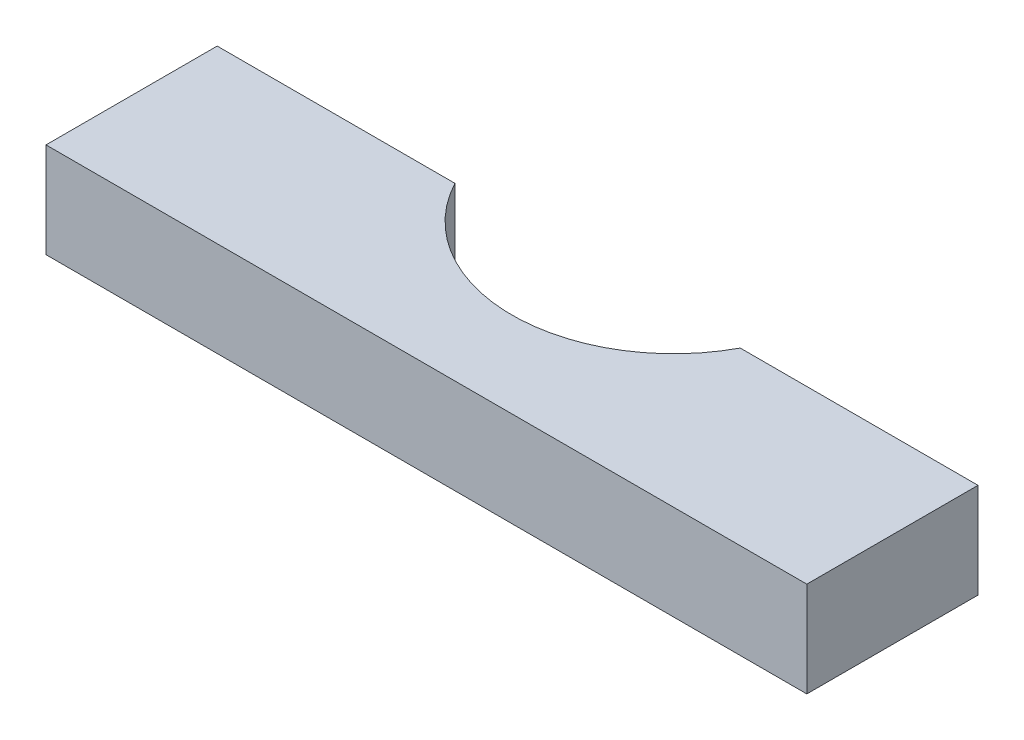
ISO-10303-21;
HEADER;
FILE_DESCRIPTION(('STEP AP214'),'2;1');
FILE_NAME('part.step','',(''),(''),'','','');
FILE_SCHEMA(('AUTOMOTIVE_DESIGN { 1 0 10303 214 1 1 1 1 }'));
ENDSEC;
DATA;
#1=APPLICATION_CONTEXT('core data for automotive mechanical design processes');
#2=APPLICATION_PROTOCOL_DEFINITION('international standard','automotive_design',2000,#1);
#3=PRODUCT_CONTEXT('',#1,'mechanical');
#4=PRODUCT('Part','Part','',(#3));
#5=PRODUCT_RELATED_PRODUCT_CATEGORY('part','',(#4));
#6=PRODUCT_DEFINITION_FORMATION('','',#4);
#7=PRODUCT_DEFINITION_CONTEXT('part definition',#1,'design');
#8=PRODUCT_DEFINITION('design','',#6,#7);
#9=PRODUCT_DEFINITION_SHAPE('','',#8);
#10=(LENGTH_UNIT() NAMED_UNIT(*) SI_UNIT(.MILLI.,.METRE.));
#11=(NAMED_UNIT(*) PLANE_ANGLE_UNIT() SI_UNIT($,.RADIAN.));
#12=(NAMED_UNIT(*) SI_UNIT($,.STERADIAN.) SOLID_ANGLE_UNIT());
#13=UNCERTAINTY_MEASURE_WITH_UNIT(LENGTH_MEASURE(1.E-05),#10,'distance_accuracy_value','');
#14=(GEOMETRIC_REPRESENTATION_CONTEXT(3) GLOBAL_UNCERTAINTY_ASSIGNED_CONTEXT((#13)) GLOBAL_UNIT_ASSIGNED_CONTEXT((#10,
#11,#12)) REPRESENTATION_CONTEXT('',''));
#15=CARTESIAN_POINT('',(0.,0.,0.));
#16=DIRECTION('',(0.,0.,1.));
#17=DIRECTION('',(1.,0.,0.));
#18=AXIS2_PLACEMENT_3D('',#15,#16,#17);
#19=CARTESIAN_POINT('',(-25.4,6.35,-5.715));
#20=DIRECTION('',(0.,0.,1.));
#21=DIRECTION('',(1.,0.,0.));
#22=AXIS2_PLACEMENT_3D('',#19,#20,#21);
#23=PLANE('',#22);
#24=DIRECTION('',(-1.,0.,0.));
#25=VECTOR('',#24,1.);
#26=CARTESIAN_POINT('',(-25.4,0.,-5.715));
#27=LINE('',#26,#25);
#28=CARTESIAN_POINT('',(25.4,0.,-5.715));
#29=VERTEX_POINT('',#28);
#30=CARTESIAN_POINT('',(9.525,0.,-5.715));
#31=VERTEX_POINT('',#30);
#32=EDGE_CURVE('E114',#29,#31,#27,.T.);
#33=ORIENTED_EDGE('',*,*,#32,.T.);
#34=DIRECTION('',(0.,1.,0.));
#35=VECTOR('',#34,1.);
#36=CARTESIAN_POINT('',(9.525,0.,-5.71500000000001));
#37=LINE('',#36,#35);
#38=CARTESIAN_POINT('',(9.525,6.35,-5.71500000000001));
#39=VERTEX_POINT('',#38);
#40=EDGE_CURVE('E48',#31,#39,#37,.T.);
#41=ORIENTED_EDGE('',*,*,#40,.T.);
#42=DIRECTION('',(-1.,0.,0.));
#43=VECTOR('',#42,1.);
#44=CARTESIAN_POINT('',(-25.4,6.35,-5.715));
#45=LINE('',#44,#43);
#46=CARTESIAN_POINT('',(25.4,6.35,-5.715));
#47=VERTEX_POINT('',#46);
#48=EDGE_CURVE('E84',#47,#39,#45,.T.);
#49=ORIENTED_EDGE('',*,*,#48,.F.);
#50=DIRECTION('',(0.,-1.,0.));
#51=VECTOR('',#50,1.);
#52=CARTESIAN_POINT('',(25.4,6.35,-5.715));
#53=LINE('',#52,#51);
#54=EDGE_CURVE('E11',#47,#29,#53,.T.);
#55=ORIENTED_EDGE('',*,*,#54,.T.);
#56=EDGE_LOOP('',(#33,#41,#49,#55));
#57=FACE_BOUND('',#56,.T.);
#58=ADVANCED_FACE('F33',(#57),#23,.F.);
#59=CARTESIAN_POINT('',(25.4,6.35,-5.715));
#60=DIRECTION('',(-1.,0.,0.));
#61=DIRECTION('',(0.,0.,1.));
#62=AXIS2_PLACEMENT_3D('',#59,#60,#61);
#63=PLANE('',#62);
#64=DIRECTION('',(0.,0.,-1.));
#65=VECTOR('',#64,1.);
#66=CARTESIAN_POINT('',(25.4,0.,-5.715));
#67=LINE('',#66,#65);
#68=CARTESIAN_POINT('',(25.4,0.,5.715));
#69=VERTEX_POINT('',#68);
#70=EDGE_CURVE('E109',#69,#29,#67,.T.);
#71=ORIENTED_EDGE('',*,*,#70,.T.);
#72=ORIENTED_EDGE('',*,*,#54,.F.);
#73=DIRECTION('',(0.,0.,-1.));
#74=VECTOR('',#73,1.);
#75=CARTESIAN_POINT('',(25.4,6.35,-5.715));
#76=LINE('',#75,#74);
#77=CARTESIAN_POINT('',(25.4,6.35,5.715));
#78=VERTEX_POINT('',#77);
#79=EDGE_CURVE('E122',#78,#47,#76,.T.);
#80=ORIENTED_EDGE('',*,*,#79,.F.);
#81=DIRECTION('',(0.,-1.,0.));
#82=VECTOR('',#81,1.);
#83=CARTESIAN_POINT('',(25.4,6.35,5.715));
#84=LINE('',#83,#82);
#85=EDGE_CURVE('E123',#78,#69,#84,.T.);
#86=ORIENTED_EDGE('',*,*,#85,.T.);
#87=EDGE_LOOP('',(#71,#72,#80,#86));
#88=FACE_BOUND('',#87,.T.);
#89=ADVANCED_FACE('F35',(#88),#63,.F.);
#90=CARTESIAN_POINT('',(-9.525,6.35,-5.715));
#91=VERTEX_POINT('',#90);
#92=CARTESIAN_POINT('',(-25.4,6.35,-5.715));
#93=VERTEX_POINT('',#92);
#94=EDGE_CURVE('E108',#91,#93,#45,.T.);
#95=ORIENTED_EDGE('',*,*,#94,.F.);
#96=DIRECTION('',(0.,1.,0.));
#97=VECTOR('',#96,1.);
#98=CARTESIAN_POINT('',(-9.525,0.,-5.715));
#99=LINE('',#98,#97);
#100=CARTESIAN_POINT('',(-9.525,0.,-5.715));
#101=VERTEX_POINT('',#100);
#102=EDGE_CURVE('E95',#101,#91,#99,.T.);
#103=ORIENTED_EDGE('',*,*,#102,.F.);
#104=CARTESIAN_POINT('',(-25.4,0.,-5.715));
#105=VERTEX_POINT('',#104);
#106=EDGE_CURVE('E106',#101,#105,#27,.T.);
#107=ORIENTED_EDGE('',*,*,#106,.T.);
#108=DIRECTION('',(0.,-1.,0.));
#109=VECTOR('',#108,1.);
#110=CARTESIAN_POINT('',(-25.4,6.35,-5.715));
#111=LINE('',#110,#109);
#112=EDGE_CURVE('E41',#93,#105,#111,.T.);
#113=ORIENTED_EDGE('',*,*,#112,.F.);
#114=EDGE_LOOP('',(#95,#103,#107,#113));
#115=FACE_BOUND('',#114,.T.);
#116=ADVANCED_FACE('F104',(#115),#23,.F.);
#117=CARTESIAN_POINT('',(-25.4,6.35,-5.715));
#118=DIRECTION('',(1.,0.,0.));
#119=DIRECTION('',(0.,0.,-1.));
#120=AXIS2_PLACEMENT_3D('',#117,#118,#119);
#121=PLANE('',#120);
#122=DIRECTION('',(0.,0.,1.));
#123=VECTOR('',#122,1.);
#124=CARTESIAN_POINT('',(-25.4,0.,-5.715));
#125=LINE('',#124,#123);
#126=CARTESIAN_POINT('',(-25.4,0.,5.715));
#127=VERTEX_POINT('',#126);
#128=EDGE_CURVE('E113',#105,#127,#125,.T.);
#129=ORIENTED_EDGE('',*,*,#128,.T.);
#130=DIRECTION('',(0.,-1.,0.));
#131=VECTOR('',#130,1.);
#132=CARTESIAN_POINT('',(-25.4,6.35,5.715));
#133=LINE('',#132,#131);
#134=CARTESIAN_POINT('',(-25.4,6.35,5.715));
#135=VERTEX_POINT('',#134);
#136=EDGE_CURVE('E125',#135,#127,#133,.T.);
#137=ORIENTED_EDGE('',*,*,#136,.F.);
#138=DIRECTION('',(0.,0.,1.));
#139=VECTOR('',#138,1.);
#140=CARTESIAN_POINT('',(-25.4,6.35,-5.715));
#141=LINE('',#140,#139);
#142=EDGE_CURVE('E130',#93,#135,#141,.T.);
#143=ORIENTED_EDGE('',*,*,#142,.F.);
#144=ORIENTED_EDGE('',*,*,#112,.T.);
#145=EDGE_LOOP('',(#129,#137,#143,#144));
#146=FACE_BOUND('',#145,.T.);
#147=ADVANCED_FACE('F128',(#146),#121,.F.);
#148=CARTESIAN_POINT('',(-25.4,6.35,5.715));
#149=DIRECTION('',(0.,0.,-1.));
#150=DIRECTION('',(-1.,0.,0.));
#151=AXIS2_PLACEMENT_3D('',#148,#149,#150);
#152=PLANE('',#151);
#153=DIRECTION('',(1.,0.,0.));
#154=VECTOR('',#153,1.);
#155=CARTESIAN_POINT('',(-25.4,0.,5.715));
#156=LINE('',#155,#154);
#157=EDGE_CURVE('E78',#127,#69,#156,.T.);
#158=ORIENTED_EDGE('',*,*,#157,.T.);
#159=ORIENTED_EDGE('',*,*,#85,.F.);
#160=DIRECTION('',(1.,0.,0.));
#161=VECTOR('',#160,1.);
#162=CARTESIAN_POINT('',(-25.4,6.35,5.715));
#163=LINE('',#162,#161);
#164=EDGE_CURVE('E57',#135,#78,#163,.T.);
#165=ORIENTED_EDGE('',*,*,#164,.F.);
#166=ORIENTED_EDGE('',*,*,#136,.T.);
#167=EDGE_LOOP('',(#158,#159,#165,#166));
#168=FACE_BOUND('',#167,.T.);
#169=ADVANCED_FACE('F141',(#168),#152,.F.);
#170=CARTESIAN_POINT('',(0.,6.35,0.));
#171=DIRECTION('',(0.,1.,0.));
#172=DIRECTION('',(0.,0.,1.));
#173=AXIS2_PLACEMENT_3D('',#170,#171,#172);
#174=PLANE('',#173);
#175=CARTESIAN_POINT('',(0.,6.35,-10.795));
#176=DIRECTION('',(0.,1.,0.));
#177=DIRECTION('',(0.,0.,1.));
#178=AXIS2_PLACEMENT_3D('',#175,#176,#177);
#179=CIRCLE('',#178,10.795);
#180=EDGE_CURVE('E100',#91,#39,#179,.T.);
#181=ORIENTED_EDGE('',*,*,#180,.F.);
#182=ORIENTED_EDGE('',*,*,#94,.T.);
#183=ORIENTED_EDGE('',*,*,#142,.T.);
#184=ORIENTED_EDGE('',*,*,#164,.T.);
#185=ORIENTED_EDGE('',*,*,#79,.T.);
#186=ORIENTED_EDGE('',*,*,#48,.T.);
#187=EDGE_LOOP('',(#181,#182,#183,#184,#185,#186));
#188=FACE_BOUND('',#187,.T.);
#189=ADVANCED_FACE('F136',(#188),#174,.T.);
#190=CARTESIAN_POINT('',(0.,0.,0.));
#191=DIRECTION('',(0.,1.,0.));
#192=DIRECTION('',(0.,0.,1.));
#193=AXIS2_PLACEMENT_3D('',#190,#191,#192);
#194=PLANE('',#193);
#195=ORIENTED_EDGE('',*,*,#106,.F.);
#196=CARTESIAN_POINT('',(0.,0.,-10.795));
#197=DIRECTION('',(0.,1.,0.));
#198=DIRECTION('',(0.,0.,1.));
#199=AXIS2_PLACEMENT_3D('',#196,#197,#198);
#200=CIRCLE('',#199,10.795);
#201=EDGE_CURVE('E92',#101,#31,#200,.T.);
#202=ORIENTED_EDGE('',*,*,#201,.T.);
#203=ORIENTED_EDGE('',*,*,#32,.F.);
#204=ORIENTED_EDGE('',*,*,#70,.F.);
#205=ORIENTED_EDGE('',*,*,#157,.F.);
#206=ORIENTED_EDGE('',*,*,#128,.F.);
#207=EDGE_LOOP('',(#195,#202,#203,#204,#205,#206));
#208=FACE_BOUND('',#207,.T.);
#209=ADVANCED_FACE('F112',(#208),#194,.F.);
#210=CARTESIAN_POINT('',(0.,0.,-10.795));
#211=DIRECTION('',(0.,1.,0.));
#212=DIRECTION('',(0.,0.,1.));
#213=AXIS2_PLACEMENT_3D('',#210,#211,#212);
#214=CYLINDRICAL_SURFACE('',#213,10.795);
#215=ORIENTED_EDGE('',*,*,#180,.T.);
#216=ORIENTED_EDGE('',*,*,#40,.F.);
#217=ORIENTED_EDGE('',*,*,#201,.F.);
#218=ORIENTED_EDGE('',*,*,#102,.T.);
#219=EDGE_LOOP('',(#215,#216,#217,#218));
#220=FACE_BOUND('',#219,.T.);
#221=ADVANCED_FACE('F94',(#220),#214,.F.);
#222=CLOSED_SHELL('',(#58,#89,#116,#147,#169,#189,#209,#221));
#223=MANIFOLD_SOLID_BREP('B2',#222);
#224=ADVANCED_BREP_SHAPE_REPRESENTATION('',(#18,#223),#14);
#225=SHAPE_DEFINITION_REPRESENTATION(#9,#224);
ENDSEC;
END-ISO-10303-21;
